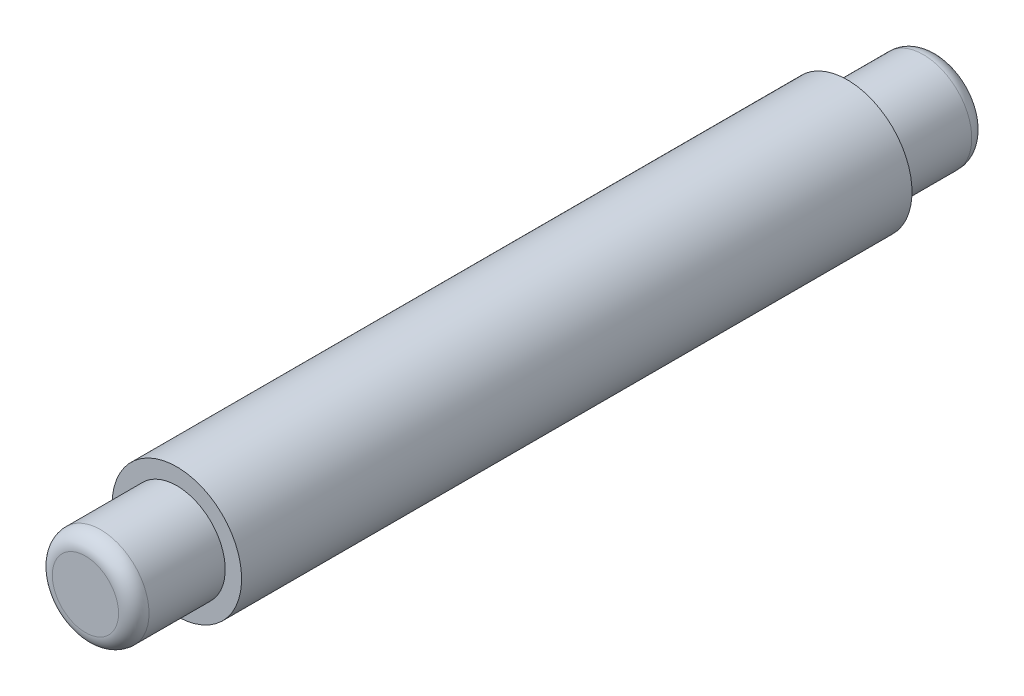
ISO-10303-21;
HEADER;
FILE_DESCRIPTION(('STEP AP214'),'2;1');
FILE_NAME('part.step','',(''),(''),'','','');
FILE_SCHEMA(('AUTOMOTIVE_DESIGN { 1 0 10303 214 1 1 1 1 }'));
ENDSEC;
DATA;
#1=APPLICATION_CONTEXT('core data for automotive mechanical design processes');
#2=APPLICATION_PROTOCOL_DEFINITION('international standard','automotive_design',2000,#1);
#3=PRODUCT_CONTEXT('',#1,'mechanical');
#4=PRODUCT('Part','Part','',(#3));
#5=PRODUCT_RELATED_PRODUCT_CATEGORY('part','',(#4));
#6=PRODUCT_DEFINITION_FORMATION('','',#4);
#7=PRODUCT_DEFINITION_CONTEXT('part definition',#1,'design');
#8=PRODUCT_DEFINITION('design','',#6,#7);
#9=PRODUCT_DEFINITION_SHAPE('','',#8);
#10=(LENGTH_UNIT() NAMED_UNIT(*) SI_UNIT(.MILLI.,.METRE.));
#11=(NAMED_UNIT(*) PLANE_ANGLE_UNIT() SI_UNIT($,.RADIAN.));
#12=(NAMED_UNIT(*) SI_UNIT($,.STERADIAN.) SOLID_ANGLE_UNIT());
#13=UNCERTAINTY_MEASURE_WITH_UNIT(LENGTH_MEASURE(1.E-05),#10,'distance_accuracy_value','');
#14=(GEOMETRIC_REPRESENTATION_CONTEXT(3) GLOBAL_UNCERTAINTY_ASSIGNED_CONTEXT((#13)) GLOBAL_UNIT_ASSIGNED_CONTEXT((#10,
#11,#12)) REPRESENTATION_CONTEXT('',''));
#15=CARTESIAN_POINT('',(0.,0.,0.));
#16=DIRECTION('',(0.,0.,1.));
#17=DIRECTION('',(1.,0.,0.));
#18=AXIS2_PLACEMENT_3D('',#15,#16,#17);
#19=CARTESIAN_POINT('',(0.,0.,6.));
#20=DIRECTION('',(0.,0.,-1.));
#21=DIRECTION('',(-1.,0.,0.));
#22=AXIS2_PLACEMENT_3D('',#19,#20,#21);
#23=CYLINDRICAL_SURFACE('',#22,3.175);
#24=CARTESIAN_POINT('',(0.,0.,5.));
#25=DIRECTION('',(0.,0.,1.));
#26=DIRECTION('',(1.,0.,0.));
#27=AXIS2_PLACEMENT_3D('',#24,#25,#26);
#28=CIRCLE('',#27,3.175);
#29=CARTESIAN_POINT('',(3.175,0.,5.));
#30=VERTEX_POINT('',#29);
#31=EDGE_CURVE('E10',#30,#30,#28,.F.);
#32=ORIENTED_EDGE('',*,*,#31,.T.);
#33=EDGE_LOOP('',(#32));
#34=FACE_BOUND('',#33,.T.);
#35=CARTESIAN_POINT('',(0.,0.,0.));
#36=DIRECTION('',(0.,0.,-1.));
#37=DIRECTION('',(-1.,0.,0.));
#38=AXIS2_PLACEMENT_3D('',#35,#36,#37);
#39=CIRCLE('',#38,3.175);
#40=CARTESIAN_POINT('',(-3.175,0.,0.));
#41=VERTEX_POINT('',#40);
#42=EDGE_CURVE('E51',#41,#41,#39,.T.);
#43=ORIENTED_EDGE('',*,*,#42,.F.);
#44=EDGE_LOOP('',(#43));
#45=FACE_BOUND('',#44,.T.);
#46=ADVANCED_FACE('F31',(#34,#45),#23,.T.);
#47=CARTESIAN_POINT('',(0.,0.,6.));
#48=DIRECTION('',(0.,0.,1.));
#49=DIRECTION('',(1.,0.,0.));
#50=AXIS2_PLACEMENT_3D('',#47,#48,#49);
#51=PLANE('',#50);
#52=CARTESIAN_POINT('',(0.,0.,6.));
#53=DIRECTION('',(0.,0.,1.));
#54=DIRECTION('',(1.,0.,0.));
#55=AXIS2_PLACEMENT_3D('',#52,#53,#54);
#56=CIRCLE('',#55,2.175);
#57=CARTESIAN_POINT('',(2.175,0.,6.));
#58=VERTEX_POINT('',#57);
#59=EDGE_CURVE('E38',#58,#58,#56,.T.);
#60=ORIENTED_EDGE('',*,*,#59,.T.);
#61=EDGE_LOOP('',(#60));
#62=FACE_BOUND('',#61,.T.);
#63=ADVANCED_FACE('F76',(#62),#51,.T.);
#64=CARTESIAN_POINT('',(0.,0.,-44.));
#65=DIRECTION('',(0.,0.,1.));
#66=DIRECTION('',(1.,0.,0.));
#67=AXIS2_PLACEMENT_3D('',#64,#65,#66);
#68=CYLINDRICAL_SURFACE('',#67,4.25);
#69=CARTESIAN_POINT('',(0.,0.,-44.));
#70=DIRECTION('',(0.,0.,-1.));
#71=DIRECTION('',(-1.,0.,0.));
#72=AXIS2_PLACEMENT_3D('',#69,#70,#71);
#73=CIRCLE('',#72,4.25);
#74=CARTESIAN_POINT('',(-4.25,0.,-44.));
#75=VERTEX_POINT('',#74);
#76=EDGE_CURVE('E54',#75,#75,#73,.T.);
#77=ORIENTED_EDGE('',*,*,#76,.F.);
#78=EDGE_LOOP('',(#77));
#79=FACE_BOUND('',#78,.T.);
#80=CARTESIAN_POINT('',(0.,0.,0.));
#81=DIRECTION('',(0.,0.,-1.));
#82=DIRECTION('',(-1.,0.,0.));
#83=AXIS2_PLACEMENT_3D('',#80,#81,#82);
#84=CIRCLE('',#83,4.25);
#85=CARTESIAN_POINT('',(-4.25,0.,0.));
#86=VERTEX_POINT('',#85);
#87=EDGE_CURVE('E55',#86,#86,#84,.T.);
#88=ORIENTED_EDGE('',*,*,#87,.T.);
#89=EDGE_LOOP('',(#88));
#90=FACE_BOUND('',#89,.T.);
#91=ADVANCED_FACE('F70',(#79,#90),#68,.T.);
#92=CARTESIAN_POINT('',(0.,0.,-44.));
#93=DIRECTION('',(0.,0.,-1.));
#94=DIRECTION('',(-1.,0.,0.));
#95=AXIS2_PLACEMENT_3D('',#92,#93,#94);
#96=PLANE('',#95);
#97=CARTESIAN_POINT('',(0.,0.,-44.));
#98=DIRECTION('',(0.,0.,-1.));
#99=DIRECTION('',(-1.,0.,0.));
#100=AXIS2_PLACEMENT_3D('',#97,#98,#99);
#101=CIRCLE('',#100,3.175);
#102=CARTESIAN_POINT('',(-3.175,0.,-44.));
#103=VERTEX_POINT('',#102);
#104=EDGE_CURVE('E58',#103,#103,#101,.T.);
#105=ORIENTED_EDGE('',*,*,#104,.F.);
#106=EDGE_LOOP('',(#105));
#107=FACE_BOUND('',#106,.T.);
#108=ORIENTED_EDGE('',*,*,#76,.T.);
#109=EDGE_LOOP('',(#108));
#110=FACE_BOUND('',#109,.T.);
#111=ADVANCED_FACE('F66',(#107,#110),#96,.T.);
#112=CARTESIAN_POINT('',(0.,0.,0.));
#113=DIRECTION('',(0.,0.,-1.));
#114=DIRECTION('',(-1.,0.,0.));
#115=AXIS2_PLACEMENT_3D('',#112,#113,#114);
#116=PLANE('',#115);
#117=ORIENTED_EDGE('',*,*,#42,.T.);
#118=EDGE_LOOP('',(#117));
#119=FACE_BOUND('',#118,.T.);
#120=ORIENTED_EDGE('',*,*,#87,.F.);
#121=EDGE_LOOP('',(#120));
#122=FACE_BOUND('',#121,.T.);
#123=ADVANCED_FACE('F69',(#119,#122),#116,.F.);
#124=CARTESIAN_POINT('',(0.,0.,-50.));
#125=DIRECTION('',(0.,0.,1.));
#126=DIRECTION('',(1.,0.,0.));
#127=AXIS2_PLACEMENT_3D('',#124,#125,#126);
#128=CYLINDRICAL_SURFACE('',#127,3.175);
#129=CARTESIAN_POINT('',(0.,0.,-49.));
#130=DIRECTION('',(0.,0.,-1.));
#131=DIRECTION('',(-1.,0.,0.));
#132=AXIS2_PLACEMENT_3D('',#129,#130,#131);
#133=CIRCLE('',#132,3.175);
#134=CARTESIAN_POINT('',(-3.175,0.,-49.));
#135=VERTEX_POINT('',#134);
#136=EDGE_CURVE('E42',#135,#135,#133,.F.);
#137=ORIENTED_EDGE('',*,*,#136,.T.);
#138=EDGE_LOOP('',(#137));
#139=FACE_BOUND('',#138,.T.);
#140=ORIENTED_EDGE('',*,*,#104,.T.);
#141=EDGE_LOOP('',(#140));
#142=FACE_BOUND('',#141,.T.);
#143=ADVANCED_FACE('F64',(#139,#142),#128,.T.);
#144=CARTESIAN_POINT('',(0.,0.,-50.));
#145=DIRECTION('',(0.,0.,-1.));
#146=DIRECTION('',(-1.,0.,0.));
#147=AXIS2_PLACEMENT_3D('',#144,#145,#146);
#148=PLANE('',#147);
#149=CARTESIAN_POINT('',(0.,0.,-50.));
#150=DIRECTION('',(0.,0.,-1.));
#151=DIRECTION('',(-1.,0.,0.));
#152=AXIS2_PLACEMENT_3D('',#149,#150,#151);
#153=CIRCLE('',#152,2.175);
#154=CARTESIAN_POINT('',(-2.175,0.,-50.));
#155=VERTEX_POINT('',#154);
#156=EDGE_CURVE('E46',#155,#155,#153,.T.);
#157=ORIENTED_EDGE('',*,*,#156,.T.);
#158=EDGE_LOOP('',(#157));
#159=FACE_BOUND('',#158,.T.);
#160=ADVANCED_FACE('F86',(#159),#148,.T.);
#161=CARTESIAN_POINT('',(0.,0.,-49.));
#162=DIRECTION('',(0.,0.,-1.));
#163=DIRECTION('',(-1.,0.,0.));
#164=AXIS2_PLACEMENT_3D('',#161,#162,#163);
#165=TOROIDAL_SURFACE('',#164,2.175,1.);
#166=ORIENTED_EDGE('',*,*,#136,.F.);
#167=EDGE_LOOP('',(#166));
#168=FACE_BOUND('',#167,.T.);
#169=ORIENTED_EDGE('',*,*,#156,.F.);
#170=EDGE_LOOP('',(#169));
#171=FACE_BOUND('',#170,.T.);
#172=ADVANCED_FACE('F96',(#168,#171),#165,.T.);
#173=CARTESIAN_POINT('',(0.,0.,5.));
#174=DIRECTION('',(0.,0.,1.));
#175=DIRECTION('',(1.,0.,0.));
#176=AXIS2_PLACEMENT_3D('',#173,#174,#175);
#177=TOROIDAL_SURFACE('',#176,2.175,1.);
#178=ORIENTED_EDGE('',*,*,#31,.F.);
#179=EDGE_LOOP('',(#178));
#180=FACE_BOUND('',#179,.T.);
#181=ORIENTED_EDGE('',*,*,#59,.F.);
#182=EDGE_LOOP('',(#181));
#183=FACE_BOUND('',#182,.T.);
#184=ADVANCED_FACE('F33',(#180,#183),#177,.T.);
#185=CLOSED_SHELL('',(#46,#63,#91,#111,#123,#143,#160,#172,#184));
#186=MANIFOLD_SOLID_BREP('B2',#185);
#187=ADVANCED_BREP_SHAPE_REPRESENTATION('',(#18,#186),#14);
#188=SHAPE_DEFINITION_REPRESENTATION(#9,#187);
ENDSEC;
END-ISO-10303-21;
